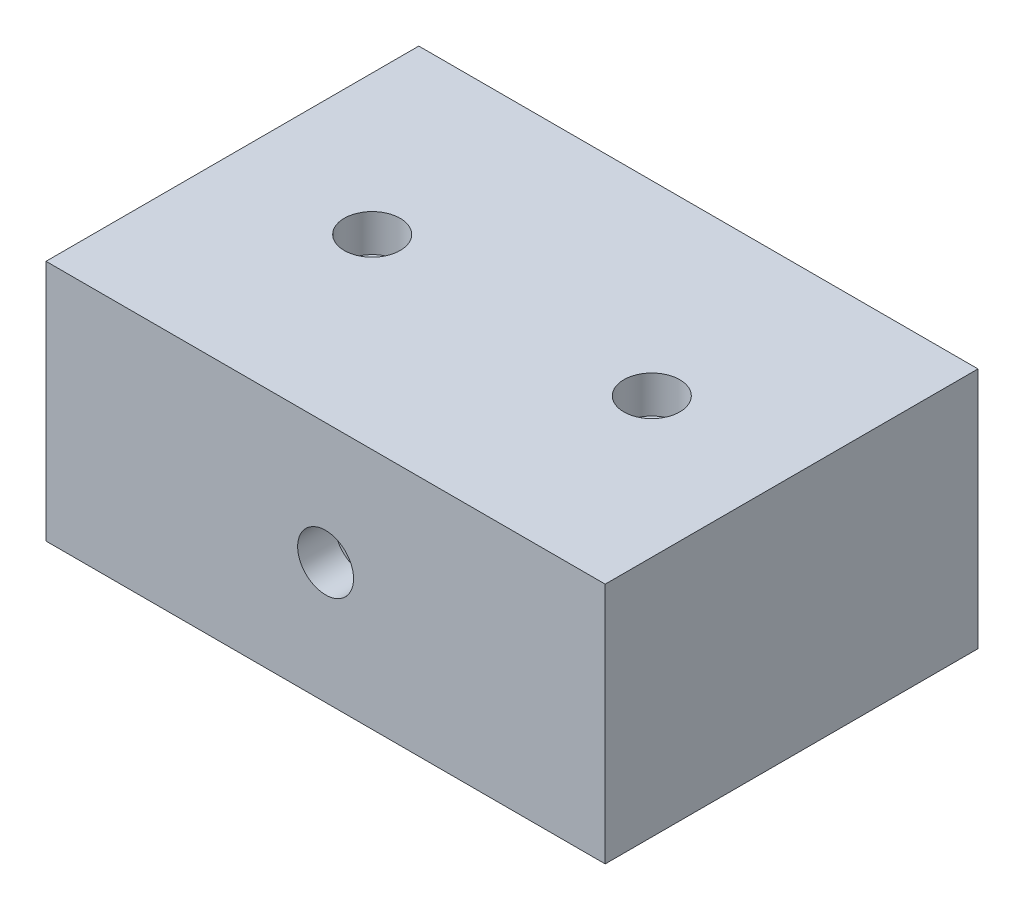
ISO-10303-21;
HEADER;
FILE_DESCRIPTION(('STEP AP214'),'2;1');
FILE_NAME('part.step','',(''),(''),'','','');
FILE_SCHEMA(('AUTOMOTIVE_DESIGN { 1 0 10303 214 1 1 1 1 }'));
ENDSEC;
DATA;
#1=APPLICATION_CONTEXT('core data for automotive mechanical design processes');
#2=APPLICATION_PROTOCOL_DEFINITION('international standard','automotive_design',2000,#1);
#3=PRODUCT_CONTEXT('',#1,'mechanical');
#4=PRODUCT('Part','Part','',(#3));
#5=PRODUCT_RELATED_PRODUCT_CATEGORY('part','',(#4));
#6=PRODUCT_DEFINITION_FORMATION('','',#4);
#7=PRODUCT_DEFINITION_CONTEXT('part definition',#1,'design');
#8=PRODUCT_DEFINITION('design','',#6,#7);
#9=PRODUCT_DEFINITION_SHAPE('','',#8);
#10=(LENGTH_UNIT() NAMED_UNIT(*) SI_UNIT(.MILLI.,.METRE.));
#11=(NAMED_UNIT(*) PLANE_ANGLE_UNIT() SI_UNIT($,.RADIAN.));
#12=(NAMED_UNIT(*) SI_UNIT($,.STERADIAN.) SOLID_ANGLE_UNIT());
#13=UNCERTAINTY_MEASURE_WITH_UNIT(LENGTH_MEASURE(1.E-05),#10,'distance_accuracy_value','');
#14=(GEOMETRIC_REPRESENTATION_CONTEXT(3) GLOBAL_UNCERTAINTY_ASSIGNED_CONTEXT((#13)) GLOBAL_UNIT_ASSIGNED_CONTEXT((#10,
#11,#12)) REPRESENTATION_CONTEXT('',''));
#15=CARTESIAN_POINT('',(0.,0.,0.));
#16=DIRECTION('',(0.,0.,1.));
#17=DIRECTION('',(1.,0.,0.));
#18=AXIS2_PLACEMENT_3D('',#15,#16,#17);
#19=CARTESIAN_POINT('',(0.,0.,20.));
#20=DIRECTION('',(1.,0.,0.));
#21=DIRECTION('',(0.,1.,0.));
#22=AXIS2_PLACEMENT_3D('',#19,#20,#21);
#23=PLANE('',#22);
#24=DIRECTION('',(0.,-1.,0.));
#25=VECTOR('',#24,1.);
#26=CARTESIAN_POINT('',(0.,0.,0.));
#27=LINE('',#26,#25);
#28=CARTESIAN_POINT('',(0.,13.,0.));
#29=VERTEX_POINT('',#28);
#30=CARTESIAN_POINT('',(0.,0.,0.));
#31=VERTEX_POINT('',#30);
#32=EDGE_CURVE('E111',#29,#31,#27,.T.);
#33=ORIENTED_EDGE('',*,*,#32,.T.);
#34=DIRECTION('',(0.,0.,-1.));
#35=VECTOR('',#34,1.);
#36=CARTESIAN_POINT('',(0.,0.,20.));
#37=LINE('',#36,#35);
#38=CARTESIAN_POINT('',(0.,0.,20.));
#39=VERTEX_POINT('',#38);
#40=EDGE_CURVE('E11',#39,#31,#37,.T.);
#41=ORIENTED_EDGE('',*,*,#40,.F.);
#42=DIRECTION('',(0.,-1.,0.));
#43=VECTOR('',#42,1.);
#44=CARTESIAN_POINT('',(0.,0.,20.));
#45=LINE('',#44,#43);
#46=CARTESIAN_POINT('',(0.,13.,20.));
#47=VERTEX_POINT('',#46);
#48=EDGE_CURVE('E95',#47,#39,#45,.T.);
#49=ORIENTED_EDGE('',*,*,#48,.F.);
#50=DIRECTION('',(0.,0.,-1.));
#51=VECTOR('',#50,1.);
#52=CARTESIAN_POINT('',(0.,13.,20.));
#53=LINE('',#52,#51);
#54=EDGE_CURVE('E107',#47,#29,#53,.T.);
#55=ORIENTED_EDGE('',*,*,#54,.T.);
#56=EDGE_LOOP('',(#33,#41,#49,#55));
#57=FACE_BOUND('',#56,.T.);
#58=ADVANCED_FACE('F43',(#57),#23,.F.);
#59=CARTESIAN_POINT('',(0.,0.,20.));
#60=DIRECTION('',(0.,1.,0.));
#61=DIRECTION('',(0.,0.,1.));
#62=AXIS2_PLACEMENT_3D('',#59,#60,#61);
#63=PLANE('',#62);
#64=DIRECTION('',(1.,0.,0.));
#65=VECTOR('',#64,1.);
#66=CARTESIAN_POINT('',(0.,0.,0.));
#67=LINE('',#66,#65);
#68=CARTESIAN_POINT('',(30.,0.,0.));
#69=VERTEX_POINT('',#68);
#70=EDGE_CURVE('E100',#31,#69,#67,.T.);
#71=ORIENTED_EDGE('',*,*,#70,.T.);
#72=DIRECTION('',(0.,0.,-1.));
#73=VECTOR('',#72,1.);
#74=CARTESIAN_POINT('',(30.,0.,20.));
#75=LINE('',#74,#73);
#76=CARTESIAN_POINT('',(30.,0.,20.));
#77=VERTEX_POINT('',#76);
#78=EDGE_CURVE('E52',#77,#69,#75,.T.);
#79=ORIENTED_EDGE('',*,*,#78,.F.);
#80=DIRECTION('',(1.,0.,0.));
#81=VECTOR('',#80,1.);
#82=CARTESIAN_POINT('',(0.,0.,20.));
#83=LINE('',#82,#81);
#84=EDGE_CURVE('E90',#39,#77,#83,.T.);
#85=ORIENTED_EDGE('',*,*,#84,.F.);
#86=ORIENTED_EDGE('',*,*,#40,.T.);
#87=EDGE_LOOP('',(#71,#79,#85,#86));
#88=FACE_BOUND('',#87,.T.);
#89=ADVANCED_FACE('F99',(#88),#63,.F.);
#90=CARTESIAN_POINT('',(30.,0.,20.));
#91=DIRECTION('',(-1.,0.,0.));
#92=DIRECTION('',(0.,-1.,0.));
#93=AXIS2_PLACEMENT_3D('',#90,#91,#92);
#94=PLANE('',#93);
#95=DIRECTION('',(0.,1.,0.));
#96=VECTOR('',#95,1.);
#97=CARTESIAN_POINT('',(30.,0.,0.));
#98=LINE('',#97,#96);
#99=CARTESIAN_POINT('',(30.,13.,0.));
#100=VERTEX_POINT('',#99);
#101=EDGE_CURVE('E77',#69,#100,#98,.T.);
#102=ORIENTED_EDGE('',*,*,#101,.T.);
#103=DIRECTION('',(0.,0.,-1.));
#104=VECTOR('',#103,1.);
#105=CARTESIAN_POINT('',(30.,13.,20.));
#106=LINE('',#105,#104);
#107=CARTESIAN_POINT('',(30.,13.,20.));
#108=VERTEX_POINT('',#107);
#109=EDGE_CURVE('E102',#108,#100,#106,.T.);
#110=ORIENTED_EDGE('',*,*,#109,.F.);
#111=DIRECTION('',(0.,1.,0.));
#112=VECTOR('',#111,1.);
#113=CARTESIAN_POINT('',(30.,0.,20.));
#114=LINE('',#113,#112);
#115=EDGE_CURVE('E93',#77,#108,#114,.T.);
#116=ORIENTED_EDGE('',*,*,#115,.F.);
#117=ORIENTED_EDGE('',*,*,#78,.T.);
#118=EDGE_LOOP('',(#102,#110,#116,#117));
#119=FACE_BOUND('',#118,.T.);
#120=ADVANCED_FACE('F103',(#119),#94,.F.);
#121=CARTESIAN_POINT('',(0.,13.,20.));
#122=DIRECTION('',(0.,-1.,0.));
#123=DIRECTION('',(0.,0.,-1.));
#124=AXIS2_PLACEMENT_3D('',#121,#122,#123);
#125=PLANE('',#124);
#126=CARTESIAN_POINT('',(7.5,13.,10.));
#127=DIRECTION('',(0.,1.,0.));
#128=DIRECTION('',(0.,0.,1.));
#129=AXIS2_PLACEMENT_3D('',#126,#127,#128);
#130=CIRCLE('',#129,1.5);
#131=CARTESIAN_POINT('',(7.5,13.,11.5));
#132=VERTEX_POINT('',#131);
#133=EDGE_CURVE('E148',#132,#132,#130,.T.);
#134=ORIENTED_EDGE('',*,*,#133,.F.);
#135=EDGE_LOOP('',(#134));
#136=FACE_BOUND('',#135,.T.);
#137=CARTESIAN_POINT('',(22.5,13.,10.));
#138=DIRECTION('',(0.,1.,0.));
#139=DIRECTION('',(0.,0.,1.));
#140=AXIS2_PLACEMENT_3D('',#137,#138,#139);
#141=CIRCLE('',#140,1.5);
#142=CARTESIAN_POINT('',(22.5,13.,11.5));
#143=VERTEX_POINT('',#142);
#144=EDGE_CURVE('E144',#143,#143,#141,.T.);
#145=ORIENTED_EDGE('',*,*,#144,.F.);
#146=EDGE_LOOP('',(#145));
#147=FACE_BOUND('',#146,.T.);
#148=DIRECTION('',(-1.,0.,0.));
#149=VECTOR('',#148,1.);
#150=CARTESIAN_POINT('',(0.,13.,0.));
#151=LINE('',#150,#149);
#152=EDGE_CURVE('E83',#100,#29,#151,.T.);
#153=ORIENTED_EDGE('',*,*,#152,.T.);
#154=ORIENTED_EDGE('',*,*,#54,.F.);
#155=DIRECTION('',(-1.,0.,0.));
#156=VECTOR('',#155,1.);
#157=CARTESIAN_POINT('',(0.,13.,20.));
#158=LINE('',#157,#156);
#159=EDGE_CURVE('E60',#108,#47,#158,.T.);
#160=ORIENTED_EDGE('',*,*,#159,.F.);
#161=ORIENTED_EDGE('',*,*,#109,.T.);
#162=EDGE_LOOP('',(#153,#154,#160,#161));
#163=FACE_BOUND('',#162,.T.);
#164=ADVANCED_FACE('F125',(#136,#147,#163),#125,.F.);
#165=CARTESIAN_POINT('',(0.,0.,20.));
#166=DIRECTION('',(0.,0.,-1.));
#167=DIRECTION('',(-1.,0.,0.));
#168=AXIS2_PLACEMENT_3D('',#165,#166,#167);
#169=PLANE('',#168);
#170=CARTESIAN_POINT('',(15.,6.5,20.));
#171=DIRECTION('',(0.,0.,1.));
#172=DIRECTION('',(1.,0.,0.));
#173=AXIS2_PLACEMENT_3D('',#170,#171,#172);
#174=CIRCLE('',#173,1.5);
#175=CARTESIAN_POINT('',(16.5,6.5,20.));
#176=VERTEX_POINT('',#175);
#177=EDGE_CURVE('E132',#176,#176,#174,.T.);
#178=ORIENTED_EDGE('',*,*,#177,.F.);
#179=EDGE_LOOP('',(#178));
#180=FACE_BOUND('',#179,.T.);
#181=ORIENTED_EDGE('',*,*,#48,.T.);
#182=ORIENTED_EDGE('',*,*,#84,.T.);
#183=ORIENTED_EDGE('',*,*,#115,.T.);
#184=ORIENTED_EDGE('',*,*,#159,.T.);
#185=EDGE_LOOP('',(#181,#182,#183,#184));
#186=FACE_BOUND('',#185,.T.);
#187=ADVANCED_FACE('F91',(#180,#186),#169,.F.);
#188=CARTESIAN_POINT('',(0.,0.,0.));
#189=DIRECTION('',(0.,0.,-1.));
#190=DIRECTION('',(-1.,0.,0.));
#191=AXIS2_PLACEMENT_3D('',#188,#189,#190);
#192=PLANE('',#191);
#193=ORIENTED_EDGE('',*,*,#32,.F.);
#194=ORIENTED_EDGE('',*,*,#152,.F.);
#195=ORIENTED_EDGE('',*,*,#101,.F.);
#196=ORIENTED_EDGE('',*,*,#70,.F.);
#197=EDGE_LOOP('',(#193,#194,#195,#196));
#198=FACE_BOUND('',#197,.T.);
#199=ADVANCED_FACE('F128',(#198),#192,.T.);
#200=CARTESIAN_POINT('',(15.,6.5,18.));
#201=DIRECTION('',(0.,0.,1.));
#202=DIRECTION('',(1.,0.,0.));
#203=AXIS2_PLACEMENT_3D('',#200,#201,#202);
#204=CYLINDRICAL_SURFACE('',#203,1.5);
#205=CARTESIAN_POINT('',(15.,6.5,18.));
#206=DIRECTION('',(0.,0.,1.));
#207=DIRECTION('',(1.,0.,0.));
#208=AXIS2_PLACEMENT_3D('',#205,#206,#207);
#209=CIRCLE('',#208,1.5);
#210=CARTESIAN_POINT('',(16.5,6.5,18.));
#211=VERTEX_POINT('',#210);
#212=EDGE_CURVE('E115',#211,#211,#209,.T.);
#213=ORIENTED_EDGE('',*,*,#212,.F.);
#214=EDGE_LOOP('',(#213));
#215=FACE_BOUND('',#214,.T.);
#216=ORIENTED_EDGE('',*,*,#177,.T.);
#217=EDGE_LOOP('',(#216));
#218=FACE_BOUND('',#217,.T.);
#219=ADVANCED_FACE('F181',(#215,#218),#204,.F.);
#220=CARTESIAN_POINT('',(15.,6.5,18.));
#221=DIRECTION('',(0.,0.,1.));
#222=DIRECTION('',(1.,0.,0.));
#223=AXIS2_PLACEMENT_3D('',#220,#221,#222);
#224=PLANE('',#223);
#225=ORIENTED_EDGE('',*,*,#212,.T.);
#226=EDGE_LOOP('',(#225));
#227=FACE_BOUND('',#226,.T.);
#228=ADVANCED_FACE('F172',(#227),#224,.T.);
#229=CARTESIAN_POINT('',(22.5,11.,10.));
#230=DIRECTION('',(0.,1.,0.));
#231=DIRECTION('',(0.,0.,1.));
#232=AXIS2_PLACEMENT_3D('',#229,#230,#231);
#233=CYLINDRICAL_SURFACE('',#232,1.5);
#234=CARTESIAN_POINT('',(22.5,11.,10.));
#235=DIRECTION('',(0.,1.,0.));
#236=DIRECTION('',(0.,0.,1.));
#237=AXIS2_PLACEMENT_3D('',#234,#235,#236);
#238=CIRCLE('',#237,1.5);
#239=CARTESIAN_POINT('',(22.5,11.,11.5));
#240=VERTEX_POINT('',#239);
#241=EDGE_CURVE('E140',#240,#240,#238,.T.);
#242=ORIENTED_EDGE('',*,*,#241,.F.);
#243=EDGE_LOOP('',(#242));
#244=FACE_BOUND('',#243,.T.);
#245=ORIENTED_EDGE('',*,*,#144,.T.);
#246=EDGE_LOOP('',(#245));
#247=FACE_BOUND('',#246,.T.);
#248=ADVANCED_FACE('F170',(#244,#247),#233,.F.);
#249=CARTESIAN_POINT('',(22.5,11.,10.));
#250=DIRECTION('',(0.,1.,0.));
#251=DIRECTION('',(0.,0.,1.));
#252=AXIS2_PLACEMENT_3D('',#249,#250,#251);
#253=PLANE('',#252);
#254=ORIENTED_EDGE('',*,*,#241,.T.);
#255=EDGE_LOOP('',(#254));
#256=FACE_BOUND('',#255,.T.);
#257=ADVANCED_FACE('F161',(#256),#253,.T.);
#258=CARTESIAN_POINT('',(7.5,11.,10.));
#259=DIRECTION('',(0.,1.,0.));
#260=DIRECTION('',(0.,0.,1.));
#261=AXIS2_PLACEMENT_3D('',#258,#259,#260);
#262=CYLINDRICAL_SURFACE('',#261,1.5);
#263=CARTESIAN_POINT('',(7.5,11.,10.));
#264=DIRECTION('',(0.,1.,0.));
#265=DIRECTION('',(0.,0.,1.));
#266=AXIS2_PLACEMENT_3D('',#263,#264,#265);
#267=CIRCLE('',#266,1.5);
#268=CARTESIAN_POINT('',(7.5,11.,11.5));
#269=VERTEX_POINT('',#268);
#270=EDGE_CURVE('E136',#269,#269,#267,.T.);
#271=ORIENTED_EDGE('',*,*,#270,.F.);
#272=EDGE_LOOP('',(#271));
#273=FACE_BOUND('',#272,.T.);
#274=ORIENTED_EDGE('',*,*,#133,.T.);
#275=EDGE_LOOP('',(#274));
#276=FACE_BOUND('',#275,.T.);
#277=ADVANCED_FACE('F158',(#273,#276),#262,.F.);
#278=CARTESIAN_POINT('',(7.5,11.,10.));
#279=DIRECTION('',(0.,1.,0.));
#280=DIRECTION('',(0.,0.,1.));
#281=AXIS2_PLACEMENT_3D('',#278,#279,#280);
#282=PLANE('',#281);
#283=ORIENTED_EDGE('',*,*,#270,.T.);
#284=EDGE_LOOP('',(#283));
#285=FACE_BOUND('',#284,.T.);
#286=ADVANCED_FACE('F156',(#285),#282,.T.);
#287=CLOSED_SHELL('',(#58,#89,#120,#164,#187,#199,#219,#228,#248,#257,#277,#286));
#288=MANIFOLD_SOLID_BREP('B2',#287);
#289=ADVANCED_BREP_SHAPE_REPRESENTATION('',(#18,#288),#14);
#290=SHAPE_DEFINITION_REPRESENTATION(#9,#289);
ENDSEC;
END-ISO-10303-21;
